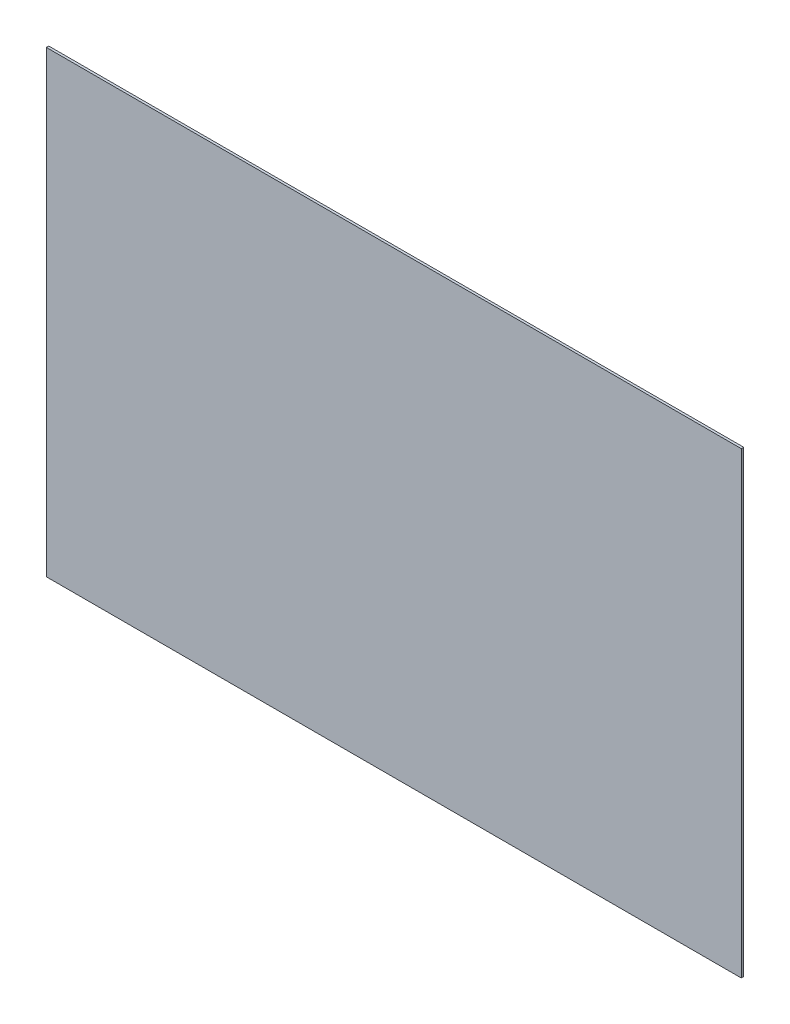
ISO-10303-21;
HEADER;
FILE_DESCRIPTION(('STEP AP214'),'2;1');
FILE_NAME('part.step','',(''),(''),'','','');
FILE_SCHEMA(('AUTOMOTIVE_DESIGN { 1 0 10303 214 1 1 1 1 }'));
ENDSEC;
DATA;
#1=APPLICATION_CONTEXT('core data for automotive mechanical design processes');
#2=APPLICATION_PROTOCOL_DEFINITION('international standard','automotive_design',2000,#1);
#3=PRODUCT_CONTEXT('',#1,'mechanical');
#4=PRODUCT('Part','Part','',(#3));
#5=PRODUCT_RELATED_PRODUCT_CATEGORY('part','',(#4));
#6=PRODUCT_DEFINITION_FORMATION('','',#4);
#7=PRODUCT_DEFINITION_CONTEXT('part definition',#1,'design');
#8=PRODUCT_DEFINITION('design','',#6,#7);
#9=PRODUCT_DEFINITION_SHAPE('','',#8);
#10=(LENGTH_UNIT() NAMED_UNIT(*) SI_UNIT(.MILLI.,.METRE.));
#11=(NAMED_UNIT(*) PLANE_ANGLE_UNIT() SI_UNIT($,.RADIAN.));
#12=(NAMED_UNIT(*) SI_UNIT($,.STERADIAN.) SOLID_ANGLE_UNIT());
#13=UNCERTAINTY_MEASURE_WITH_UNIT(LENGTH_MEASURE(1.E-05),#10,'distance_accuracy_value','');
#14=(GEOMETRIC_REPRESENTATION_CONTEXT(3) GLOBAL_UNCERTAINTY_ASSIGNED_CONTEXT((#13)) GLOBAL_UNIT_ASSIGNED_CONTEXT((#10,
#11,#12)) REPRESENTATION_CONTEXT('',''));
#15=CARTESIAN_POINT('',(0.,0.,0.));
#16=DIRECTION('',(0.,0.,1.));
#17=DIRECTION('',(1.,0.,0.));
#18=AXIS2_PLACEMENT_3D('',#15,#16,#17);
#19=CARTESIAN_POINT('',(457.2,301.625,3.175));
#20=DIRECTION('',(-1.,0.,0.));
#21=DIRECTION('',(0.,-1.,0.));
#22=AXIS2_PLACEMENT_3D('',#19,#20,#21);
#23=PLANE('',#22);
#24=DIRECTION('',(0.,1.,0.));
#25=VECTOR('',#24,1.);
#26=CARTESIAN_POINT('',(457.2,301.625,0.));
#27=LINE('',#26,#25);
#28=CARTESIAN_POINT('',(457.2,-301.625,0.));
#29=VERTEX_POINT('',#28);
#30=CARTESIAN_POINT('',(457.2,301.625,0.));
#31=VERTEX_POINT('',#30);
#32=EDGE_CURVE('E107',#29,#31,#27,.T.);
#33=ORIENTED_EDGE('',*,*,#32,.T.);
#34=DIRECTION('',(0.,0.,-1.));
#35=VECTOR('',#34,1.);
#36=CARTESIAN_POINT('',(457.2,301.625,3.175));
#37=LINE('',#36,#35);
#38=CARTESIAN_POINT('',(457.2,301.625,3.175));
#39=VERTEX_POINT('',#38);
#40=EDGE_CURVE('E11',#39,#31,#37,.T.);
#41=ORIENTED_EDGE('',*,*,#40,.F.);
#42=DIRECTION('',(0.,1.,0.));
#43=VECTOR('',#42,1.);
#44=CARTESIAN_POINT('',(457.2,301.625,3.175));
#45=LINE('',#44,#43);
#46=CARTESIAN_POINT('',(457.2,-301.625,3.175));
#47=VERTEX_POINT('',#46);
#48=EDGE_CURVE('E91',#47,#39,#45,.T.);
#49=ORIENTED_EDGE('',*,*,#48,.F.);
#50=DIRECTION('',(0.,0.,-1.));
#51=VECTOR('',#50,1.);
#52=CARTESIAN_POINT('',(457.2,-301.625,3.175));
#53=LINE('',#52,#51);
#54=EDGE_CURVE('E103',#47,#29,#53,.T.);
#55=ORIENTED_EDGE('',*,*,#54,.T.);
#56=EDGE_LOOP('',(#33,#41,#49,#55));
#57=FACE_BOUND('',#56,.T.);
#58=ADVANCED_FACE('F39',(#57),#23,.F.);
#59=CARTESIAN_POINT('',(-457.2,301.625,3.175));
#60=DIRECTION('',(0.,-1.,0.));
#61=DIRECTION('',(0.,0.,-1.));
#62=AXIS2_PLACEMENT_3D('',#59,#60,#61);
#63=PLANE('',#62);
#64=DIRECTION('',(-1.,0.,0.));
#65=VECTOR('',#64,1.);
#66=CARTESIAN_POINT('',(-457.2,301.625,0.));
#67=LINE('',#66,#65);
#68=CARTESIAN_POINT('',(-457.2,301.625,0.));
#69=VERTEX_POINT('',#68);
#70=EDGE_CURVE('E96',#31,#69,#67,.T.);
#71=ORIENTED_EDGE('',*,*,#70,.T.);
#72=DIRECTION('',(0.,0.,-1.));
#73=VECTOR('',#72,1.);
#74=CARTESIAN_POINT('',(-457.2,301.625,3.175));
#75=LINE('',#74,#73);
#76=CARTESIAN_POINT('',(-457.2,301.625,3.175));
#77=VERTEX_POINT('',#76);
#78=EDGE_CURVE('E48',#77,#69,#75,.T.);
#79=ORIENTED_EDGE('',*,*,#78,.F.);
#80=DIRECTION('',(-1.,0.,0.));
#81=VECTOR('',#80,1.);
#82=CARTESIAN_POINT('',(-457.2,301.625,3.175));
#83=LINE('',#82,#81);
#84=EDGE_CURVE('E86',#39,#77,#83,.T.);
#85=ORIENTED_EDGE('',*,*,#84,.F.);
#86=ORIENTED_EDGE('',*,*,#40,.T.);
#87=EDGE_LOOP('',(#71,#79,#85,#86));
#88=FACE_BOUND('',#87,.T.);
#89=ADVANCED_FACE('F95',(#88),#63,.F.);
#90=CARTESIAN_POINT('',(-457.2,301.625,3.175));
#91=DIRECTION('',(1.,0.,0.));
#92=DIRECTION('',(0.,1.,0.));
#93=AXIS2_PLACEMENT_3D('',#90,#91,#92);
#94=PLANE('',#93);
#95=DIRECTION('',(0.,-1.,0.));
#96=VECTOR('',#95,1.);
#97=CARTESIAN_POINT('',(-457.2,301.625,0.));
#98=LINE('',#97,#96);
#99=CARTESIAN_POINT('',(-457.2,-301.625,0.));
#100=VERTEX_POINT('',#99);
#101=EDGE_CURVE('E73',#69,#100,#98,.T.);
#102=ORIENTED_EDGE('',*,*,#101,.T.);
#103=DIRECTION('',(0.,0.,-1.));
#104=VECTOR('',#103,1.);
#105=CARTESIAN_POINT('',(-457.2,-301.625,3.175));
#106=LINE('',#105,#104);
#107=CARTESIAN_POINT('',(-457.2,-301.625,3.175));
#108=VERTEX_POINT('',#107);
#109=EDGE_CURVE('E98',#108,#100,#106,.T.);
#110=ORIENTED_EDGE('',*,*,#109,.F.);
#111=DIRECTION('',(0.,-1.,0.));
#112=VECTOR('',#111,1.);
#113=CARTESIAN_POINT('',(-457.2,301.625,3.175));
#114=LINE('',#113,#112);
#115=EDGE_CURVE('E89',#77,#108,#114,.T.);
#116=ORIENTED_EDGE('',*,*,#115,.F.);
#117=ORIENTED_EDGE('',*,*,#78,.T.);
#118=EDGE_LOOP('',(#102,#110,#116,#117));
#119=FACE_BOUND('',#118,.T.);
#120=ADVANCED_FACE('F99',(#119),#94,.F.);
#121=CARTESIAN_POINT('',(-457.2,-301.625,3.175));
#122=DIRECTION('',(0.,1.,0.));
#123=DIRECTION('',(0.,0.,1.));
#124=AXIS2_PLACEMENT_3D('',#121,#122,#123);
#125=PLANE('',#124);
#126=DIRECTION('',(1.,0.,0.));
#127=VECTOR('',#126,1.);
#128=CARTESIAN_POINT('',(-457.2,-301.625,0.));
#129=LINE('',#128,#127);
#130=EDGE_CURVE('E79',#100,#29,#129,.T.);
#131=ORIENTED_EDGE('',*,*,#130,.T.);
#132=ORIENTED_EDGE('',*,*,#54,.F.);
#133=DIRECTION('',(1.,0.,0.));
#134=VECTOR('',#133,1.);
#135=CARTESIAN_POINT('',(-457.2,-301.625,3.175));
#136=LINE('',#135,#134);
#137=EDGE_CURVE('E56',#108,#47,#136,.T.);
#138=ORIENTED_EDGE('',*,*,#137,.F.);
#139=ORIENTED_EDGE('',*,*,#109,.T.);
#140=EDGE_LOOP('',(#131,#132,#138,#139));
#141=FACE_BOUND('',#140,.T.);
#142=ADVANCED_FACE('F120',(#141),#125,.F.);
#143=CARTESIAN_POINT('',(0.,0.,3.175));
#144=DIRECTION('',(0.,0.,1.));
#145=DIRECTION('',(1.,0.,0.));
#146=AXIS2_PLACEMENT_3D('',#143,#144,#145);
#147=PLANE('',#146);
#148=ORIENTED_EDGE('',*,*,#48,.T.);
#149=ORIENTED_EDGE('',*,*,#84,.T.);
#150=ORIENTED_EDGE('',*,*,#115,.T.);
#151=ORIENTED_EDGE('',*,*,#137,.T.);
#152=EDGE_LOOP('',(#148,#149,#150,#151));
#153=FACE_BOUND('',#152,.T.);
#154=ADVANCED_FACE('F87',(#153),#147,.T.);
#155=CARTESIAN_POINT('',(0.,0.,0.));
#156=DIRECTION('',(0.,0.,1.));
#157=DIRECTION('',(1.,0.,0.));
#158=AXIS2_PLACEMENT_3D('',#155,#156,#157);
#159=PLANE('',#158);
#160=ORIENTED_EDGE('',*,*,#32,.F.);
#161=ORIENTED_EDGE('',*,*,#130,.F.);
#162=ORIENTED_EDGE('',*,*,#101,.F.);
#163=ORIENTED_EDGE('',*,*,#70,.F.);
#164=EDGE_LOOP('',(#160,#161,#162,#163));
#165=FACE_BOUND('',#164,.T.);
#166=ADVANCED_FACE('F123',(#165),#159,.F.);
#167=CLOSED_SHELL('',(#58,#89,#120,#142,#154,#166));
#168=MANIFOLD_SOLID_BREP('B2',#167);
#169=ADVANCED_BREP_SHAPE_REPRESENTATION('',(#18,#168),#14);
#170=SHAPE_DEFINITION_REPRESENTATION(#9,#169);
ENDSEC;
END-ISO-10303-21;
